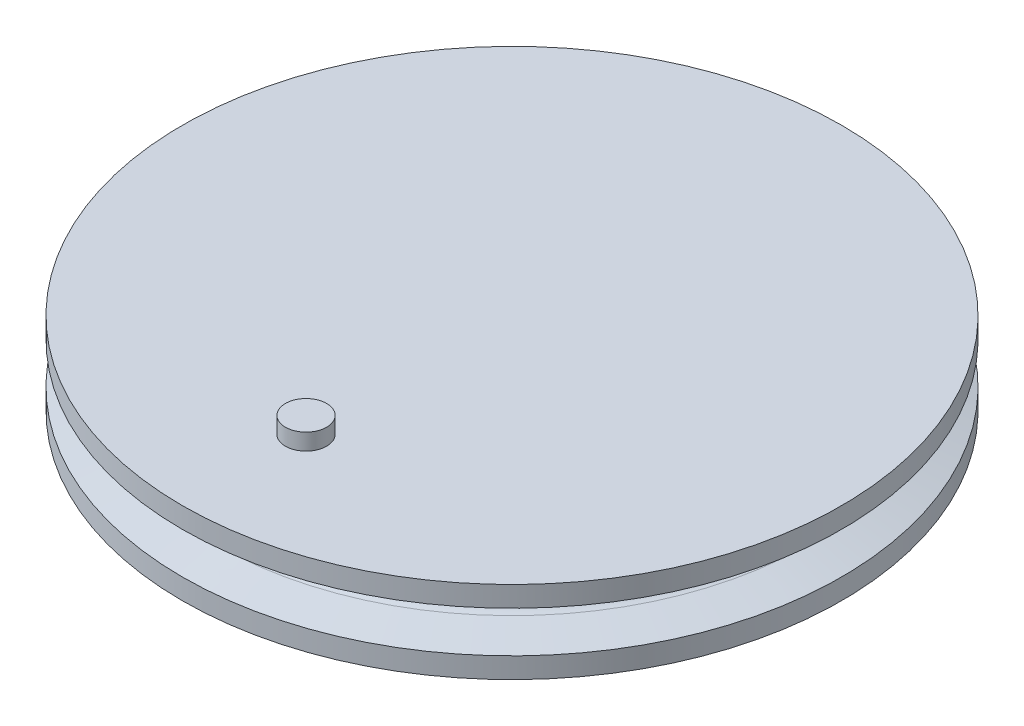
ISO-10303-21;
HEADER;
FILE_DESCRIPTION(('STEP AP214'),'2;1');
FILE_NAME('part.step','',(''),(''),'','','');
FILE_SCHEMA(('AUTOMOTIVE_DESIGN { 1 0 10303 214 1 1 1 1 }'));
ENDSEC;
DATA;
#1=APPLICATION_CONTEXT('core data for automotive mechanical design processes');
#2=APPLICATION_PROTOCOL_DEFINITION('international standard','automotive_design',2000,#1);
#3=PRODUCT_CONTEXT('',#1,'mechanical');
#4=PRODUCT('Part','Part','',(#3));
#5=PRODUCT_RELATED_PRODUCT_CATEGORY('part','',(#4));
#6=PRODUCT_DEFINITION_FORMATION('','',#4);
#7=PRODUCT_DEFINITION_CONTEXT('part definition',#1,'design');
#8=PRODUCT_DEFINITION('design','',#6,#7);
#9=PRODUCT_DEFINITION_SHAPE('','',#8);
#10=(LENGTH_UNIT() NAMED_UNIT(*) SI_UNIT(.MILLI.,.METRE.));
#11=(NAMED_UNIT(*) PLANE_ANGLE_UNIT() SI_UNIT($,.RADIAN.));
#12=(NAMED_UNIT(*) SI_UNIT($,.STERADIAN.) SOLID_ANGLE_UNIT());
#13=UNCERTAINTY_MEASURE_WITH_UNIT(LENGTH_MEASURE(1.E-05),#10,'distance_accuracy_value','');
#14=(GEOMETRIC_REPRESENTATION_CONTEXT(3) GLOBAL_UNCERTAINTY_ASSIGNED_CONTEXT((#13)) GLOBAL_UNIT_ASSIGNED_CONTEXT((#10,
#11,#12)) REPRESENTATION_CONTEXT('',''));
#15=CARTESIAN_POINT('',(0.,0.,0.));
#16=DIRECTION('',(0.,0.,1.));
#17=DIRECTION('',(1.,0.,0.));
#18=AXIS2_PLACEMENT_3D('',#15,#16,#17);
#19=CARTESIAN_POINT('',(0.,0.,0.));
#20=DIRECTION('',(0.,1.,0.));
#21=DIRECTION('',(0.,0.,1.));
#22=AXIS2_PLACEMENT_3D('',#19,#20,#21);
#23=PLANE('',#22);
#24=CARTESIAN_POINT('',(0.,0.,0.));
#25=DIRECTION('',(0.,-1.,0.));
#26=DIRECTION('',(0.,0.,-1.));
#27=AXIS2_PLACEMENT_3D('',#24,#25,#26);
#28=CIRCLE('',#27,5.);
#29=CARTESIAN_POINT('',(0.,0.,-5.));
#30=VERTEX_POINT('',#29);
#31=EDGE_CURVE('E71',#30,#30,#28,.T.);
#32=ORIENTED_EDGE('',*,*,#31,.F.);
#33=EDGE_LOOP('',(#32));
#34=FACE_BOUND('',#33,.T.);
#35=CARTESIAN_POINT('',(0.,0.,0.));
#36=DIRECTION('',(0.,1.,0.));
#37=DIRECTION('',(0.,0.,1.));
#38=AXIS2_PLACEMENT_3D('',#35,#36,#37);
#39=CIRCLE('',#38,40.);
#40=CARTESIAN_POINT('',(0.,0.,40.));
#41=VERTEX_POINT('',#40);
#42=EDGE_CURVE('E10',#41,#41,#39,.T.);
#43=ORIENTED_EDGE('',*,*,#42,.F.);
#44=EDGE_LOOP('',(#43));
#45=FACE_BOUND('',#44,.T.);
#46=ADVANCED_FACE('F39',(#34,#45),#23,.F.);
#47=CARTESIAN_POINT('',(0.,5.,0.));
#48=DIRECTION('',(0.,1.,0.));
#49=DIRECTION('',(0.,0.,1.));
#50=AXIS2_PLACEMENT_3D('',#47,#48,#49);
#51=TOROIDAL_SURFACE('',#50,36.25,1.25);
#52=CARTESIAN_POINT('',(0.,6.19156777359743,0.));
#53=DIRECTION('',(0.,1.,0.));
#54=DIRECTION('',(0.,0.,1.));
#55=AXIS2_PLACEMENT_3D('',#52,#53,#54);
#56=CIRCLE('',#55,35.872288150935);
#57=CARTESIAN_POINT('',(0.,6.19156777359743,35.872288150935));
#58=VERTEX_POINT('',#57);
#59=EDGE_CURVE('E56',#58,#58,#56,.T.);
#60=ORIENTED_EDGE('',*,*,#59,.F.);
#61=EDGE_LOOP('',(#60));
#62=FACE_BOUND('',#61,.T.);
#63=CARTESIAN_POINT('',(0.,3.80843222640257,0.));
#64=DIRECTION('',(0.,1.,0.));
#65=DIRECTION('',(0.,0.,1.));
#66=AXIS2_PLACEMENT_3D('',#63,#64,#65);
#67=CIRCLE('',#66,35.872288150935);
#68=CARTESIAN_POINT('',(0.,3.80843222640257,35.872288150935));
#69=VERTEX_POINT('',#68);
#70=EDGE_CURVE('E51',#69,#69,#67,.T.);
#71=ORIENTED_EDGE('',*,*,#70,.T.);
#72=EDGE_LOOP('',(#71));
#73=FACE_BOUND('',#72,.T.);
#74=ADVANCED_FACE('F115',(#62,#73),#51,.F.);
#75=CARTESIAN_POINT('',(0.,10.,0.));
#76=DIRECTION('',(0.,1.,0.));
#77=DIRECTION('',(0.,0.,1.));
#78=AXIS2_PLACEMENT_3D('',#75,#76,#77);
#79=CYLINDRICAL_SURFACE('',#78,40.);
#80=CARTESIAN_POINT('',(0.,2.5,0.));
#81=DIRECTION('',(0.,1.,0.));
#82=DIRECTION('',(0.,0.,1.));
#83=AXIS2_PLACEMENT_3D('',#80,#81,#82);
#84=CIRCLE('',#83,40.);
#85=CARTESIAN_POINT('',(0.,2.5,40.));
#86=VERTEX_POINT('',#85);
#87=EDGE_CURVE('E46',#86,#86,#84,.T.);
#88=ORIENTED_EDGE('',*,*,#87,.F.);
#89=EDGE_LOOP('',(#88));
#90=FACE_BOUND('',#89,.T.);
#91=ORIENTED_EDGE('',*,*,#42,.T.);
#92=EDGE_LOOP('',(#91));
#93=FACE_BOUND('',#92,.T.);
#94=ADVANCED_FACE('F118',(#90,#93),#79,.T.);
#95=CARTESIAN_POINT('',(0.,2.5,0.));
#96=DIRECTION('',(0.,-1.,0.));
#97=DIRECTION('',(0.,0.,-1.));
#98=AXIS2_PLACEMENT_3D('',#95,#96,#97);
#99=CONICAL_SURFACE('',#98,40.,1.26382862475014);
#100=ORIENTED_EDGE('',*,*,#70,.F.);
#101=EDGE_LOOP('',(#100));
#102=FACE_BOUND('',#101,.T.);
#103=ORIENTED_EDGE('',*,*,#87,.T.);
#104=EDGE_LOOP('',(#103));
#105=FACE_BOUND('',#104,.T.);
#106=ADVANCED_FACE('F111',(#102,#105),#99,.T.);
#107=CARTESIAN_POINT('',(0.,6.19156777359743,0.));
#108=DIRECTION('',(0.,1.,0.));
#109=DIRECTION('',(0.,0.,1.));
#110=AXIS2_PLACEMENT_3D('',#107,#108,#109);
#111=CONICAL_SURFACE('',#110,35.872288150935,1.26382862475014);
#112=CARTESIAN_POINT('',(0.,7.5,0.));
#113=DIRECTION('',(0.,1.,0.));
#114=DIRECTION('',(0.,0.,1.));
#115=AXIS2_PLACEMENT_3D('',#112,#113,#114);
#116=CIRCLE('',#115,40.);
#117=CARTESIAN_POINT('',(0.,7.5,40.));
#118=VERTEX_POINT('',#117);
#119=EDGE_CURVE('E62',#118,#118,#116,.T.);
#120=ORIENTED_EDGE('',*,*,#119,.F.);
#121=EDGE_LOOP('',(#120));
#122=FACE_BOUND('',#121,.T.);
#123=ORIENTED_EDGE('',*,*,#59,.T.);
#124=EDGE_LOOP('',(#123));
#125=FACE_BOUND('',#124,.T.);
#126=ADVANCED_FACE('F105',(#122,#125),#111,.T.);
#127=CARTESIAN_POINT('',(0.,10.,0.));
#128=DIRECTION('',(0.,1.,0.));
#129=DIRECTION('',(0.,0.,1.));
#130=AXIS2_PLACEMENT_3D('',#127,#128,#129);
#131=CYLINDRICAL_SURFACE('',#130,40.);
#132=CARTESIAN_POINT('',(0.,10.,0.));
#133=DIRECTION('',(0.,1.,0.));
#134=DIRECTION('',(0.,0.,1.));
#135=AXIS2_PLACEMENT_3D('',#132,#133,#134);
#136=CIRCLE('',#135,40.);
#137=CARTESIAN_POINT('',(0.,10.,40.));
#138=VERTEX_POINT('',#137);
#139=EDGE_CURVE('E66',#138,#138,#136,.T.);
#140=ORIENTED_EDGE('',*,*,#139,.F.);
#141=EDGE_LOOP('',(#140));
#142=FACE_BOUND('',#141,.T.);
#143=ORIENTED_EDGE('',*,*,#119,.T.);
#144=EDGE_LOOP('',(#143));
#145=FACE_BOUND('',#144,.T.);
#146=ADVANCED_FACE('F100',(#142,#145),#131,.T.);
#147=CARTESIAN_POINT('',(0.,10.,0.));
#148=DIRECTION('',(0.,1.,0.));
#149=DIRECTION('',(0.,0.,1.));
#150=AXIS2_PLACEMENT_3D('',#147,#148,#149);
#151=PLANE('',#150);
#152=CARTESIAN_POINT('',(0.,10.,25.));
#153=DIRECTION('',(0.,1.,0.));
#154=DIRECTION('',(0.,0.,1.));
#155=AXIS2_PLACEMENT_3D('',#152,#153,#154);
#156=CIRCLE('',#155,2.5);
#157=CARTESIAN_POINT('',(0.,10.,27.5));
#158=VERTEX_POINT('',#157);
#159=EDGE_CURVE('E79',#158,#158,#156,.T.);
#160=ORIENTED_EDGE('',*,*,#159,.F.);
#161=EDGE_LOOP('',(#160));
#162=FACE_BOUND('',#161,.T.);
#163=ORIENTED_EDGE('',*,*,#139,.T.);
#164=EDGE_LOOP('',(#163));
#165=FACE_BOUND('',#164,.T.);
#166=ADVANCED_FACE('F96',(#162,#165),#151,.T.);
#167=CARTESIAN_POINT('',(0.,5.,0.));
#168=DIRECTION('',(0.,-1.,0.));
#169=DIRECTION('',(0.,0.,-1.));
#170=AXIS2_PLACEMENT_3D('',#167,#168,#169);
#171=CYLINDRICAL_SURFACE('',#170,5.);
#172=CARTESIAN_POINT('',(0.,5.,0.));
#173=DIRECTION('',(0.,-1.,0.));
#174=DIRECTION('',(0.,0.,-1.));
#175=AXIS2_PLACEMENT_3D('',#172,#173,#174);
#176=CIRCLE('',#175,5.);
#177=CARTESIAN_POINT('',(0.,5.,-5.));
#178=VERTEX_POINT('',#177);
#179=EDGE_CURVE('E70',#178,#178,#176,.T.);
#180=ORIENTED_EDGE('',*,*,#179,.F.);
#181=EDGE_LOOP('',(#180));
#182=FACE_BOUND('',#181,.T.);
#183=ORIENTED_EDGE('',*,*,#31,.T.);
#184=EDGE_LOOP('',(#183));
#185=FACE_BOUND('',#184,.T.);
#186=ADVANCED_FACE('F99',(#182,#185),#171,.F.);
#187=CARTESIAN_POINT('',(0.,5.,0.));
#188=DIRECTION('',(0.,-1.,0.));
#189=DIRECTION('',(0.,0.,-1.));
#190=AXIS2_PLACEMENT_3D('',#187,#188,#189);
#191=PLANE('',#190);
#192=ORIENTED_EDGE('',*,*,#179,.T.);
#193=EDGE_LOOP('',(#192));
#194=FACE_BOUND('',#193,.T.);
#195=ADVANCED_FACE('F92',(#194),#191,.T.);
#196=CARTESIAN_POINT('',(0.,12.,25.));
#197=DIRECTION('',(0.,-1.,0.));
#198=DIRECTION('',(0.,0.,-1.));
#199=AXIS2_PLACEMENT_3D('',#196,#197,#198);
#200=CYLINDRICAL_SURFACE('',#199,2.5);
#201=CARTESIAN_POINT('',(0.,12.,25.));
#202=DIRECTION('',(0.,1.,0.));
#203=DIRECTION('',(0.,0.,1.));
#204=AXIS2_PLACEMENT_3D('',#201,#202,#203);
#205=CIRCLE('',#204,2.5);
#206=CARTESIAN_POINT('',(0.,12.,27.5));
#207=VERTEX_POINT('',#206);
#208=EDGE_CURVE('E75',#207,#207,#205,.T.);
#209=ORIENTED_EDGE('',*,*,#208,.F.);
#210=EDGE_LOOP('',(#209));
#211=FACE_BOUND('',#210,.T.);
#212=ORIENTED_EDGE('',*,*,#159,.T.);
#213=EDGE_LOOP('',(#212));
#214=FACE_BOUND('',#213,.T.);
#215=ADVANCED_FACE('F89',(#211,#214),#200,.T.);
#216=CARTESIAN_POINT('',(0.,12.,25.));
#217=DIRECTION('',(0.,1.,0.));
#218=DIRECTION('',(0.,0.,1.));
#219=AXIS2_PLACEMENT_3D('',#216,#217,#218);
#220=PLANE('',#219);
#221=ORIENTED_EDGE('',*,*,#208,.T.);
#222=EDGE_LOOP('',(#221));
#223=FACE_BOUND('',#222,.T.);
#224=ADVANCED_FACE('F87',(#223),#220,.T.);
#225=CLOSED_SHELL('',(#46,#74,#94,#106,#126,#146,#166,#186,#195,#215,#224));
#226=MANIFOLD_SOLID_BREP('B2',#225);
#227=ADVANCED_BREP_SHAPE_REPRESENTATION('',(#18,#226),#14);
#228=SHAPE_DEFINITION_REPRESENTATION(#9,#227);
ENDSEC;
END-ISO-10303-21;
